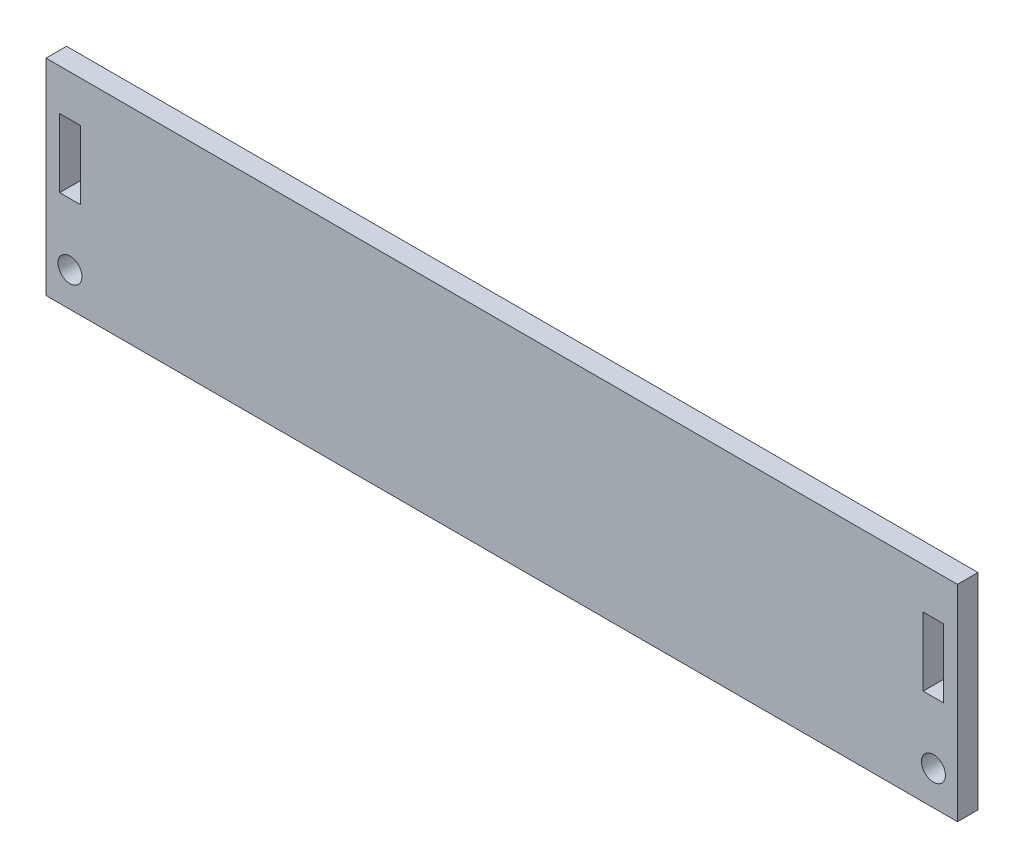
ISO-10303-21;
HEADER;
FILE_DESCRIPTION(('STEP AP214'),'2;1');
FILE_NAME('part.step','',(''),(''),'','','');
FILE_SCHEMA(('AUTOMOTIVE_DESIGN { 1 0 10303 214 1 1 1 1 }'));
ENDSEC;
DATA;
#1=APPLICATION_CONTEXT('core data for automotive mechanical design processes');
#2=APPLICATION_PROTOCOL_DEFINITION('international standard','automotive_design',2000,#1);
#3=PRODUCT_CONTEXT('',#1,'mechanical');
#4=PRODUCT('Part','Part','',(#3));
#5=PRODUCT_RELATED_PRODUCT_CATEGORY('part','',(#4));
#6=PRODUCT_DEFINITION_FORMATION('','',#4);
#7=PRODUCT_DEFINITION_CONTEXT('part definition',#1,'design');
#8=PRODUCT_DEFINITION('design','',#6,#7);
#9=PRODUCT_DEFINITION_SHAPE('','',#8);
#10=(LENGTH_UNIT() NAMED_UNIT(*) SI_UNIT(.MILLI.,.METRE.));
#11=(NAMED_UNIT(*) PLANE_ANGLE_UNIT() SI_UNIT($,.RADIAN.));
#12=(NAMED_UNIT(*) SI_UNIT($,.STERADIAN.) SOLID_ANGLE_UNIT());
#13=UNCERTAINTY_MEASURE_WITH_UNIT(LENGTH_MEASURE(1.E-05),#10,'distance_accuracy_value','');
#14=(GEOMETRIC_REPRESENTATION_CONTEXT(3) GLOBAL_UNCERTAINTY_ASSIGNED_CONTEXT((#13)) GLOBAL_UNIT_ASSIGNED_CONTEXT((#10,
#11,#12)) REPRESENTATION_CONTEXT('',''));
#15=CARTESIAN_POINT('',(0.,0.,0.));
#16=DIRECTION('',(0.,0.,1.));
#17=DIRECTION('',(1.,0.,0.));
#18=AXIS2_PLACEMENT_3D('',#15,#16,#17);
#19=CARTESIAN_POINT('',(0.,0.,3.));
#20=DIRECTION('',(0.,0.,1.));
#21=DIRECTION('',(1.,0.,0.));
#22=AXIS2_PLACEMENT_3D('',#19,#20,#21);
#23=PLANE('',#22);
#24=CARTESIAN_POINT('',(-63.,-7.5,3.));
#25=DIRECTION('',(0.,0.,1.));
#26=DIRECTION('',(1.,0.,0.));
#27=AXIS2_PLACEMENT_3D('',#24,#25,#26);
#28=CIRCLE('',#27,1.75);
#29=CARTESIAN_POINT('',(-61.25,-7.5,3.));
#30=VERTEX_POINT('',#29);
#31=EDGE_CURVE('E151',#30,#30,#28,.T.);
#32=ORIENTED_EDGE('',*,*,#31,.F.);
#33=EDGE_LOOP('',(#32));
#34=FACE_BOUND('',#33,.T.);
#35=DIRECTION('',(0.,-1.,0.));
#36=VECTOR('',#35,1.);
#37=CARTESIAN_POINT('',(-66.5,17.5,3.));
#38=LINE('',#37,#36);
#39=CARTESIAN_POINT('',(-66.5,17.5,3.));
#40=VERTEX_POINT('',#39);
#41=CARTESIAN_POINT('',(-66.5,-12.5,3.));
#42=VERTEX_POINT('',#41);
#43=EDGE_CURVE('E192',#40,#42,#38,.T.);
#44=ORIENTED_EDGE('',*,*,#43,.T.);
#45=DIRECTION('',(1.,0.,0.));
#46=VECTOR('',#45,1.);
#47=CARTESIAN_POINT('',(-66.5,-12.5,3.));
#48=LINE('',#47,#46);
#49=CARTESIAN_POINT('',(66.5,-12.5,3.));
#50=VERTEX_POINT('',#49);
#51=EDGE_CURVE('E195',#42,#50,#48,.T.);
#52=ORIENTED_EDGE('',*,*,#51,.T.);
#53=DIRECTION('',(0.,1.,0.));
#54=VECTOR('',#53,1.);
#55=CARTESIAN_POINT('',(66.5,17.5,3.));
#56=LINE('',#55,#54);
#57=CARTESIAN_POINT('',(66.5,17.5,3.));
#58=VERTEX_POINT('',#57);
#59=EDGE_CURVE('E198',#50,#58,#56,.T.);
#60=ORIENTED_EDGE('',*,*,#59,.T.);
#61=DIRECTION('',(-1.,0.,0.));
#62=VECTOR('',#61,1.);
#63=CARTESIAN_POINT('',(-66.5,17.5,3.));
#64=LINE('',#63,#62);
#65=EDGE_CURVE('E200',#58,#40,#64,.T.);
#66=ORIENTED_EDGE('',*,*,#65,.T.);
#67=EDGE_LOOP('',(#44,#52,#60,#66));
#68=FACE_BOUND('',#67,.T.);
#69=DIRECTION('',(-1.,0.,0.));
#70=VECTOR('',#69,1.);
#71=CARTESIAN_POINT('',(-64.5,11.5,3.));
#72=LINE('',#71,#70);
#73=CARTESIAN_POINT('',(-61.5,11.5,3.));
#74=VERTEX_POINT('',#73);
#75=CARTESIAN_POINT('',(-64.5,11.5,3.));
#76=VERTEX_POINT('',#75);
#77=EDGE_CURVE('E163',#74,#76,#72,.T.);
#78=ORIENTED_EDGE('',*,*,#77,.F.);
#79=DIRECTION('',(0.,1.,0.));
#80=VECTOR('',#79,1.);
#81=CARTESIAN_POINT('',(-61.5,11.5,3.));
#82=LINE('',#81,#80);
#83=CARTESIAN_POINT('',(-61.5,1.5,3.));
#84=VERTEX_POINT('',#83);
#85=EDGE_CURVE('E161',#84,#74,#82,.T.);
#86=ORIENTED_EDGE('',*,*,#85,.F.);
#87=DIRECTION('',(1.,0.,0.));
#88=VECTOR('',#87,1.);
#89=CARTESIAN_POINT('',(-64.5,1.5,3.));
#90=LINE('',#89,#88);
#91=CARTESIAN_POINT('',(-64.5,1.5,3.));
#92=VERTEX_POINT('',#91);
#93=EDGE_CURVE('E169',#92,#84,#90,.T.);
#94=ORIENTED_EDGE('',*,*,#93,.F.);
#95=DIRECTION('',(0.,-1.,0.));
#96=VECTOR('',#95,1.);
#97=CARTESIAN_POINT('',(-64.5,11.5,3.));
#98=LINE('',#97,#96);
#99=EDGE_CURVE('E166',#76,#92,#98,.T.);
#100=ORIENTED_EDGE('',*,*,#99,.F.);
#101=EDGE_LOOP('',(#78,#86,#94,#100));
#102=FACE_BOUND('',#101,.T.);
#103=DIRECTION('',(0.,1.,0.));
#104=VECTOR('',#103,1.);
#105=CARTESIAN_POINT('',(64.5,11.5,3.));
#106=LINE('',#105,#104);
#107=CARTESIAN_POINT('',(64.5,1.5,3.));
#108=VERTEX_POINT('',#107);
#109=CARTESIAN_POINT('',(64.5,11.5,3.));
#110=VERTEX_POINT('',#109);
#111=EDGE_CURVE('E130',#108,#110,#106,.T.);
#112=ORIENTED_EDGE('',*,*,#111,.F.);
#113=DIRECTION('',(1.,0.,0.));
#114=VECTOR('',#113,1.);
#115=CARTESIAN_POINT('',(61.5,1.5,3.));
#116=LINE('',#115,#114);
#117=CARTESIAN_POINT('',(61.5,1.5,3.));
#118=VERTEX_POINT('',#117);
#119=EDGE_CURVE('E122',#118,#108,#116,.T.);
#120=ORIENTED_EDGE('',*,*,#119,.F.);
#121=DIRECTION('',(0.,-1.,0.));
#122=VECTOR('',#121,1.);
#123=CARTESIAN_POINT('',(61.5,11.5,3.));
#124=LINE('',#123,#122);
#125=CARTESIAN_POINT('',(61.5,11.5,3.));
#126=VERTEX_POINT('',#125);
#127=EDGE_CURVE('E145',#126,#118,#124,.T.);
#128=ORIENTED_EDGE('',*,*,#127,.F.);
#129=DIRECTION('',(-1.,0.,0.));
#130=VECTOR('',#129,1.);
#131=CARTESIAN_POINT('',(61.5,11.5,3.));
#132=LINE('',#131,#130);
#133=EDGE_CURVE('E143',#110,#126,#132,.T.);
#134=ORIENTED_EDGE('',*,*,#133,.F.);
#135=EDGE_LOOP('',(#112,#120,#128,#134));
#136=FACE_BOUND('',#135,.T.);
#137=CARTESIAN_POINT('',(63.,-7.5,3.));
#138=DIRECTION('',(0.,0.,1.));
#139=DIRECTION('',(1.,0.,0.));
#140=AXIS2_PLACEMENT_3D('',#137,#138,#139);
#141=CIRCLE('',#140,1.75);
#142=CARTESIAN_POINT('',(64.75,-7.5,3.));
#143=VERTEX_POINT('',#142);
#144=EDGE_CURVE('E309',#143,#143,#141,.T.);
#145=ORIENTED_EDGE('',*,*,#144,.F.);
#146=EDGE_LOOP('',(#145));
#147=FACE_BOUND('',#146,.T.);
#148=ADVANCED_FACE('F33',(#34,#68,#102,#136,#147),#23,.T.);
#149=CARTESIAN_POINT('',(0.,0.,0.));
#150=DIRECTION('',(0.,0.,1.));
#151=DIRECTION('',(1.,0.,0.));
#152=AXIS2_PLACEMENT_3D('',#149,#150,#151);
#153=PLANE('',#152);
#154=DIRECTION('',(0.,1.,0.));
#155=VECTOR('',#154,1.);
#156=CARTESIAN_POINT('',(-61.5,11.5,0.));
#157=LINE('',#156,#155);
#158=CARTESIAN_POINT('',(-61.5,1.5,0.));
#159=VERTEX_POINT('',#158);
#160=CARTESIAN_POINT('',(-61.5,11.5,0.));
#161=VERTEX_POINT('',#160);
#162=EDGE_CURVE('E138',#159,#161,#157,.T.);
#163=ORIENTED_EDGE('',*,*,#162,.T.);
#164=DIRECTION('',(-1.,0.,0.));
#165=VECTOR('',#164,1.);
#166=CARTESIAN_POINT('',(-64.5,11.5,0.));
#167=LINE('',#166,#165);
#168=CARTESIAN_POINT('',(-64.5,11.5,0.));
#169=VERTEX_POINT('',#168);
#170=EDGE_CURVE('E174',#161,#169,#167,.T.);
#171=ORIENTED_EDGE('',*,*,#170,.T.);
#172=DIRECTION('',(0.,-1.,0.));
#173=VECTOR('',#172,1.);
#174=CARTESIAN_POINT('',(-64.5,11.5,0.));
#175=LINE('',#174,#173);
#176=CARTESIAN_POINT('',(-64.5,1.5,0.));
#177=VERTEX_POINT('',#176);
#178=EDGE_CURVE('E177',#169,#177,#175,.T.);
#179=ORIENTED_EDGE('',*,*,#178,.T.);
#180=DIRECTION('',(1.,0.,0.));
#181=VECTOR('',#180,1.);
#182=CARTESIAN_POINT('',(-64.5,1.5,0.));
#183=LINE('',#182,#181);
#184=EDGE_CURVE('E164',#177,#159,#183,.T.);
#185=ORIENTED_EDGE('',*,*,#184,.T.);
#186=EDGE_LOOP('',(#163,#171,#179,#185));
#187=FACE_BOUND('',#186,.T.);
#188=DIRECTION('',(0.,-1.,0.));
#189=VECTOR('',#188,1.);
#190=CARTESIAN_POINT('',(-66.5,17.5,0.));
#191=LINE('',#190,#189);
#192=CARTESIAN_POINT('',(-66.5,17.5,0.));
#193=VERTEX_POINT('',#192);
#194=CARTESIAN_POINT('',(-66.5,-12.5,0.));
#195=VERTEX_POINT('',#194);
#196=EDGE_CURVE('E191',#193,#195,#191,.T.);
#197=ORIENTED_EDGE('',*,*,#196,.F.);
#198=DIRECTION('',(-1.,0.,0.));
#199=VECTOR('',#198,1.);
#200=CARTESIAN_POINT('',(-66.5,17.5,0.));
#201=LINE('',#200,#199);
#202=CARTESIAN_POINT('',(66.5,17.5,0.));
#203=VERTEX_POINT('',#202);
#204=EDGE_CURVE('E196',#203,#193,#201,.T.);
#205=ORIENTED_EDGE('',*,*,#204,.F.);
#206=DIRECTION('',(0.,1.,0.));
#207=VECTOR('',#206,1.);
#208=CARTESIAN_POINT('',(66.5,17.5,0.));
#209=LINE('',#208,#207);
#210=CARTESIAN_POINT('',(66.5,-12.5,0.));
#211=VERTEX_POINT('',#210);
#212=EDGE_CURVE('E207',#211,#203,#209,.T.);
#213=ORIENTED_EDGE('',*,*,#212,.F.);
#214=DIRECTION('',(1.,0.,0.));
#215=VECTOR('',#214,1.);
#216=CARTESIAN_POINT('',(-66.5,-12.5,0.));
#217=LINE('',#216,#215);
#218=EDGE_CURVE('E205',#195,#211,#217,.T.);
#219=ORIENTED_EDGE('',*,*,#218,.F.);
#220=EDGE_LOOP('',(#197,#205,#213,#219));
#221=FACE_BOUND('',#220,.T.);
#222=DIRECTION('',(1.,0.,0.));
#223=VECTOR('',#222,1.);
#224=CARTESIAN_POINT('',(61.5,1.5,0.));
#225=LINE('',#224,#223);
#226=CARTESIAN_POINT('',(61.5,1.5,0.));
#227=VERTEX_POINT('',#226);
#228=CARTESIAN_POINT('',(64.5,1.5,0.));
#229=VERTEX_POINT('',#228);
#230=EDGE_CURVE('E56',#227,#229,#225,.T.);
#231=ORIENTED_EDGE('',*,*,#230,.T.);
#232=DIRECTION('',(0.,1.,0.));
#233=VECTOR('',#232,1.);
#234=CARTESIAN_POINT('',(64.5,11.5,0.));
#235=LINE('',#234,#233);
#236=CARTESIAN_POINT('',(64.5,11.5,0.));
#237=VERTEX_POINT('',#236);
#238=EDGE_CURVE('E137',#229,#237,#235,.T.);
#239=ORIENTED_EDGE('',*,*,#238,.T.);
#240=DIRECTION('',(-1.,0.,0.));
#241=VECTOR('',#240,1.);
#242=CARTESIAN_POINT('',(61.5,11.5,0.));
#243=LINE('',#242,#241);
#244=CARTESIAN_POINT('',(61.5,11.5,0.));
#245=VERTEX_POINT('',#244);
#246=EDGE_CURVE('E153',#237,#245,#243,.T.);
#247=ORIENTED_EDGE('',*,*,#246,.T.);
#248=DIRECTION('',(0.,-1.,0.));
#249=VECTOR('',#248,1.);
#250=CARTESIAN_POINT('',(61.5,11.5,0.));
#251=LINE('',#250,#249);
#252=EDGE_CURVE('E131',#245,#227,#251,.T.);
#253=ORIENTED_EDGE('',*,*,#252,.T.);
#254=EDGE_LOOP('',(#231,#239,#247,#253));
#255=FACE_BOUND('',#254,.T.);
#256=CARTESIAN_POINT('',(-63.,-7.5,0.));
#257=DIRECTION('',(0.,0.,1.));
#258=DIRECTION('',(1.,0.,0.));
#259=AXIS2_PLACEMENT_3D('',#256,#257,#258);
#260=CIRCLE('',#259,1.75);
#261=CARTESIAN_POINT('',(-61.25,-7.5,0.));
#262=VERTEX_POINT('',#261);
#263=EDGE_CURVE('E315',#262,#262,#260,.T.);
#264=ORIENTED_EDGE('',*,*,#263,.T.);
#265=EDGE_LOOP('',(#264));
#266=FACE_BOUND('',#265,.T.);
#267=CARTESIAN_POINT('',(63.,-7.5,0.));
#268=DIRECTION('',(0.,0.,1.));
#269=DIRECTION('',(1.,0.,0.));
#270=AXIS2_PLACEMENT_3D('',#267,#268,#269);
#271=CIRCLE('',#270,1.75);
#272=CARTESIAN_POINT('',(64.75,-7.5,0.));
#273=VERTEX_POINT('',#272);
#274=EDGE_CURVE('E312',#273,#273,#271,.T.);
#275=ORIENTED_EDGE('',*,*,#274,.T.);
#276=EDGE_LOOP('',(#275));
#277=FACE_BOUND('',#276,.T.);
#278=ADVANCED_FACE('F225',(#187,#221,#255,#266,#277),#153,.F.);
#279=CARTESIAN_POINT('',(-66.5,17.5,3.));
#280=DIRECTION('',(1.,0.,0.));
#281=DIRECTION('',(0.,1.,0.));
#282=AXIS2_PLACEMENT_3D('',#279,#280,#281);
#283=PLANE('',#282);
#284=ORIENTED_EDGE('',*,*,#196,.T.);
#285=DIRECTION('',(0.,0.,-1.));
#286=VECTOR('',#285,1.);
#287=CARTESIAN_POINT('',(-66.5,-12.5,3.));
#288=LINE('',#287,#286);
#289=EDGE_CURVE('E11',#42,#195,#288,.T.);
#290=ORIENTED_EDGE('',*,*,#289,.F.);
#291=ORIENTED_EDGE('',*,*,#43,.F.);
#292=DIRECTION('',(0.,0.,-1.));
#293=VECTOR('',#292,1.);
#294=CARTESIAN_POINT('',(-66.5,17.5,3.));
#295=LINE('',#294,#293);
#296=EDGE_CURVE('E202',#40,#193,#295,.T.);
#297=ORIENTED_EDGE('',*,*,#296,.T.);
#298=EDGE_LOOP('',(#284,#290,#291,#297));
#299=FACE_BOUND('',#298,.T.);
#300=ADVANCED_FACE('F35',(#299),#283,.F.);
#301=CARTESIAN_POINT('',(-66.5,-12.5,3.));
#302=DIRECTION('',(0.,1.,0.));
#303=DIRECTION('',(0.,0.,1.));
#304=AXIS2_PLACEMENT_3D('',#301,#302,#303);
#305=PLANE('',#304);
#306=ORIENTED_EDGE('',*,*,#218,.T.);
#307=DIRECTION('',(0.,0.,-1.));
#308=VECTOR('',#307,1.);
#309=CARTESIAN_POINT('',(66.5,-12.5,3.));
#310=LINE('',#309,#308);
#311=EDGE_CURVE('E41',#50,#211,#310,.T.);
#312=ORIENTED_EDGE('',*,*,#311,.F.);
#313=ORIENTED_EDGE('',*,*,#51,.F.);
#314=ORIENTED_EDGE('',*,*,#289,.T.);
#315=EDGE_LOOP('',(#306,#312,#313,#314));
#316=FACE_BOUND('',#315,.T.);
#317=ADVANCED_FACE('F236',(#316),#305,.F.);
#318=CARTESIAN_POINT('',(66.5,17.5,3.));
#319=DIRECTION('',(-1.,0.,0.));
#320=DIRECTION('',(0.,-1.,0.));
#321=AXIS2_PLACEMENT_3D('',#318,#319,#320);
#322=PLANE('',#321);
#323=ORIENTED_EDGE('',*,*,#212,.T.);
#324=DIRECTION('',(0.,0.,-1.));
#325=VECTOR('',#324,1.);
#326=CARTESIAN_POINT('',(66.5,17.5,3.));
#327=LINE('',#326,#325);
#328=EDGE_CURVE('E212',#58,#203,#327,.T.);
#329=ORIENTED_EDGE('',*,*,#328,.F.);
#330=ORIENTED_EDGE('',*,*,#59,.F.);
#331=ORIENTED_EDGE('',*,*,#311,.T.);
#332=EDGE_LOOP('',(#323,#329,#330,#331));
#333=FACE_BOUND('',#332,.T.);
#334=ADVANCED_FACE('F219',(#333),#322,.F.);
#335=CARTESIAN_POINT('',(-66.5,17.5,3.));
#336=DIRECTION('',(0.,-1.,0.));
#337=DIRECTION('',(0.,0.,-1.));
#338=AXIS2_PLACEMENT_3D('',#335,#336,#337);
#339=PLANE('',#338);
#340=ORIENTED_EDGE('',*,*,#204,.T.);
#341=ORIENTED_EDGE('',*,*,#296,.F.);
#342=ORIENTED_EDGE('',*,*,#65,.F.);
#343=ORIENTED_EDGE('',*,*,#328,.T.);
#344=EDGE_LOOP('',(#340,#341,#342,#343));
#345=FACE_BOUND('',#344,.T.);
#346=ADVANCED_FACE('F229',(#345),#339,.F.);
#347=CARTESIAN_POINT('',(-61.5,11.5,3.));
#348=DIRECTION('',(-1.,0.,0.));
#349=DIRECTION('',(0.,0.,1.));
#350=AXIS2_PLACEMENT_3D('',#347,#348,#349);
#351=PLANE('',#350);
#352=ORIENTED_EDGE('',*,*,#162,.F.);
#353=DIRECTION('',(0.,0.,-1.));
#354=VECTOR('',#353,1.);
#355=CARTESIAN_POINT('',(-61.5,1.5,3.));
#356=LINE('',#355,#354);
#357=EDGE_CURVE('E171',#84,#159,#356,.T.);
#358=ORIENTED_EDGE('',*,*,#357,.F.);
#359=ORIENTED_EDGE('',*,*,#85,.T.);
#360=DIRECTION('',(0.,0.,-1.));
#361=VECTOR('',#360,1.);
#362=CARTESIAN_POINT('',(-61.5,11.5,3.));
#363=LINE('',#362,#361);
#364=EDGE_CURVE('E188',#74,#161,#363,.T.);
#365=ORIENTED_EDGE('',*,*,#364,.T.);
#366=EDGE_LOOP('',(#352,#358,#359,#365));
#367=FACE_BOUND('',#366,.T.);
#368=ADVANCED_FACE('F253',(#367),#351,.T.);
#369=CARTESIAN_POINT('',(-64.5,11.5,3.));
#370=DIRECTION('',(0.,-1.,0.));
#371=DIRECTION('',(0.,0.,-1.));
#372=AXIS2_PLACEMENT_3D('',#369,#370,#371);
#373=PLANE('',#372);
#374=ORIENTED_EDGE('',*,*,#170,.F.);
#375=ORIENTED_EDGE('',*,*,#364,.F.);
#376=ORIENTED_EDGE('',*,*,#77,.T.);
#377=DIRECTION('',(0.,0.,-1.));
#378=VECTOR('',#377,1.);
#379=CARTESIAN_POINT('',(-64.5,11.5,3.));
#380=LINE('',#379,#378);
#381=EDGE_CURVE('E186',#76,#169,#380,.T.);
#382=ORIENTED_EDGE('',*,*,#381,.T.);
#383=EDGE_LOOP('',(#374,#375,#376,#382));
#384=FACE_BOUND('',#383,.T.);
#385=ADVANCED_FACE('F260',(#384),#373,.T.);
#386=CARTESIAN_POINT('',(-64.5,11.5,3.));
#387=DIRECTION('',(1.,0.,0.));
#388=DIRECTION('',(0.,0.,-1.));
#389=AXIS2_PLACEMENT_3D('',#386,#387,#388);
#390=PLANE('',#389);
#391=ORIENTED_EDGE('',*,*,#178,.F.);
#392=ORIENTED_EDGE('',*,*,#381,.F.);
#393=ORIENTED_EDGE('',*,*,#99,.T.);
#394=DIRECTION('',(0.,0.,-1.));
#395=VECTOR('',#394,1.);
#396=CARTESIAN_POINT('',(-64.5,1.5,3.));
#397=LINE('',#396,#395);
#398=EDGE_CURVE('E184',#92,#177,#397,.T.);
#399=ORIENTED_EDGE('',*,*,#398,.T.);
#400=EDGE_LOOP('',(#391,#392,#393,#399));
#401=FACE_BOUND('',#400,.T.);
#402=ADVANCED_FACE('F265',(#401),#390,.T.);
#403=CARTESIAN_POINT('',(-64.5,1.5,3.));
#404=DIRECTION('',(0.,1.,0.));
#405=DIRECTION('',(0.,0.,1.));
#406=AXIS2_PLACEMENT_3D('',#403,#404,#405);
#407=PLANE('',#406);
#408=ORIENTED_EDGE('',*,*,#184,.F.);
#409=ORIENTED_EDGE('',*,*,#398,.F.);
#410=ORIENTED_EDGE('',*,*,#93,.T.);
#411=ORIENTED_EDGE('',*,*,#357,.T.);
#412=EDGE_LOOP('',(#408,#409,#410,#411));
#413=FACE_BOUND('',#412,.T.);
#414=ADVANCED_FACE('F272',(#413),#407,.T.);
#415=CARTESIAN_POINT('',(61.5,1.5,3.));
#416=DIRECTION('',(0.,1.,0.));
#417=DIRECTION('',(0.,0.,1.));
#418=AXIS2_PLACEMENT_3D('',#415,#416,#417);
#419=PLANE('',#418);
#420=ORIENTED_EDGE('',*,*,#230,.F.);
#421=DIRECTION('',(0.,0.,-1.));
#422=VECTOR('',#421,1.);
#423=CARTESIAN_POINT('',(61.5,1.5,3.));
#424=LINE('',#423,#422);
#425=EDGE_CURVE('E126',#118,#227,#424,.T.);
#426=ORIENTED_EDGE('',*,*,#425,.F.);
#427=ORIENTED_EDGE('',*,*,#119,.T.);
#428=DIRECTION('',(0.,0.,-1.));
#429=VECTOR('',#428,1.);
#430=CARTESIAN_POINT('',(64.5,1.5,3.));
#431=LINE('',#430,#429);
#432=EDGE_CURVE('E125',#108,#229,#431,.T.);
#433=ORIENTED_EDGE('',*,*,#432,.T.);
#434=EDGE_LOOP('',(#420,#426,#427,#433));
#435=FACE_BOUND('',#434,.T.);
#436=ADVANCED_FACE('F124',(#435),#419,.T.);
#437=CARTESIAN_POINT('',(64.5,11.5,3.));
#438=DIRECTION('',(-1.,0.,0.));
#439=DIRECTION('',(0.,0.,1.));
#440=AXIS2_PLACEMENT_3D('',#437,#438,#439);
#441=PLANE('',#440);
#442=ORIENTED_EDGE('',*,*,#238,.F.);
#443=ORIENTED_EDGE('',*,*,#432,.F.);
#444=ORIENTED_EDGE('',*,*,#111,.T.);
#445=DIRECTION('',(0.,0.,-1.));
#446=VECTOR('',#445,1.);
#447=CARTESIAN_POINT('',(64.5,11.5,3.));
#448=LINE('',#447,#446);
#449=EDGE_CURVE('E139',#110,#237,#448,.T.);
#450=ORIENTED_EDGE('',*,*,#449,.T.);
#451=EDGE_LOOP('',(#442,#443,#444,#450));
#452=FACE_BOUND('',#451,.T.);
#453=ADVANCED_FACE('F134',(#452),#441,.T.);
#454=CARTESIAN_POINT('',(61.5,11.5,3.));
#455=DIRECTION('',(0.,-1.,0.));
#456=DIRECTION('',(0.,0.,-1.));
#457=AXIS2_PLACEMENT_3D('',#454,#455,#456);
#458=PLANE('',#457);
#459=ORIENTED_EDGE('',*,*,#246,.F.);
#460=ORIENTED_EDGE('',*,*,#449,.F.);
#461=ORIENTED_EDGE('',*,*,#133,.T.);
#462=DIRECTION('',(0.,0.,-1.));
#463=VECTOR('',#462,1.);
#464=CARTESIAN_POINT('',(61.5,11.5,3.));
#465=LINE('',#464,#463);
#466=EDGE_CURVE('E48',#126,#245,#465,.T.);
#467=ORIENTED_EDGE('',*,*,#466,.T.);
#468=EDGE_LOOP('',(#459,#460,#461,#467));
#469=FACE_BOUND('',#468,.T.);
#470=ADVANCED_FACE('F290',(#469),#458,.T.);
#471=CARTESIAN_POINT('',(61.5,11.5,3.));
#472=DIRECTION('',(1.,0.,0.));
#473=DIRECTION('',(0.,0.,-1.));
#474=AXIS2_PLACEMENT_3D('',#471,#472,#473);
#475=PLANE('',#474);
#476=ORIENTED_EDGE('',*,*,#252,.F.);
#477=ORIENTED_EDGE('',*,*,#466,.F.);
#478=ORIENTED_EDGE('',*,*,#127,.T.);
#479=ORIENTED_EDGE('',*,*,#425,.T.);
#480=EDGE_LOOP('',(#476,#477,#478,#479));
#481=FACE_BOUND('',#480,.T.);
#482=ADVANCED_FACE('F293',(#481),#475,.T.);
#483=CARTESIAN_POINT('',(-63.,-7.5,3.));
#484=DIRECTION('',(0.,0.,-1.));
#485=DIRECTION('',(-1.,0.,0.));
#486=AXIS2_PLACEMENT_3D('',#483,#484,#485);
#487=CYLINDRICAL_SURFACE('',#486,1.75);
#488=ORIENTED_EDGE('',*,*,#31,.T.);
#489=EDGE_LOOP('',(#488));
#490=FACE_BOUND('',#489,.T.);
#491=ORIENTED_EDGE('',*,*,#263,.F.);
#492=EDGE_LOOP('',(#491));
#493=FACE_BOUND('',#492,.T.);
#494=ADVANCED_FACE('F297',(#490,#493),#487,.F.);
#495=CARTESIAN_POINT('',(63.,-7.5,3.));
#496=DIRECTION('',(0.,0.,-1.));
#497=DIRECTION('',(-1.,0.,0.));
#498=AXIS2_PLACEMENT_3D('',#495,#496,#497);
#499=CYLINDRICAL_SURFACE('',#498,1.75);
#500=ORIENTED_EDGE('',*,*,#144,.T.);
#501=EDGE_LOOP('',(#500));
#502=FACE_BOUND('',#501,.T.);
#503=ORIENTED_EDGE('',*,*,#274,.F.);
#504=EDGE_LOOP('',(#503));
#505=FACE_BOUND('',#504,.T.);
#506=ADVANCED_FACE('F300',(#502,#505),#499,.F.);
#507=CLOSED_SHELL('',(#148,#278,#300,#317,#334,#346,#368,#385,#402,#414,#436,#453,#470,#482,
#494,#506));
#508=MANIFOLD_SOLID_BREP('B2',#507);
#509=ADVANCED_BREP_SHAPE_REPRESENTATION('',(#18,#508),#14);
#510=SHAPE_DEFINITION_REPRESENTATION(#9,#509);
ENDSEC;
END-ISO-10303-21;
